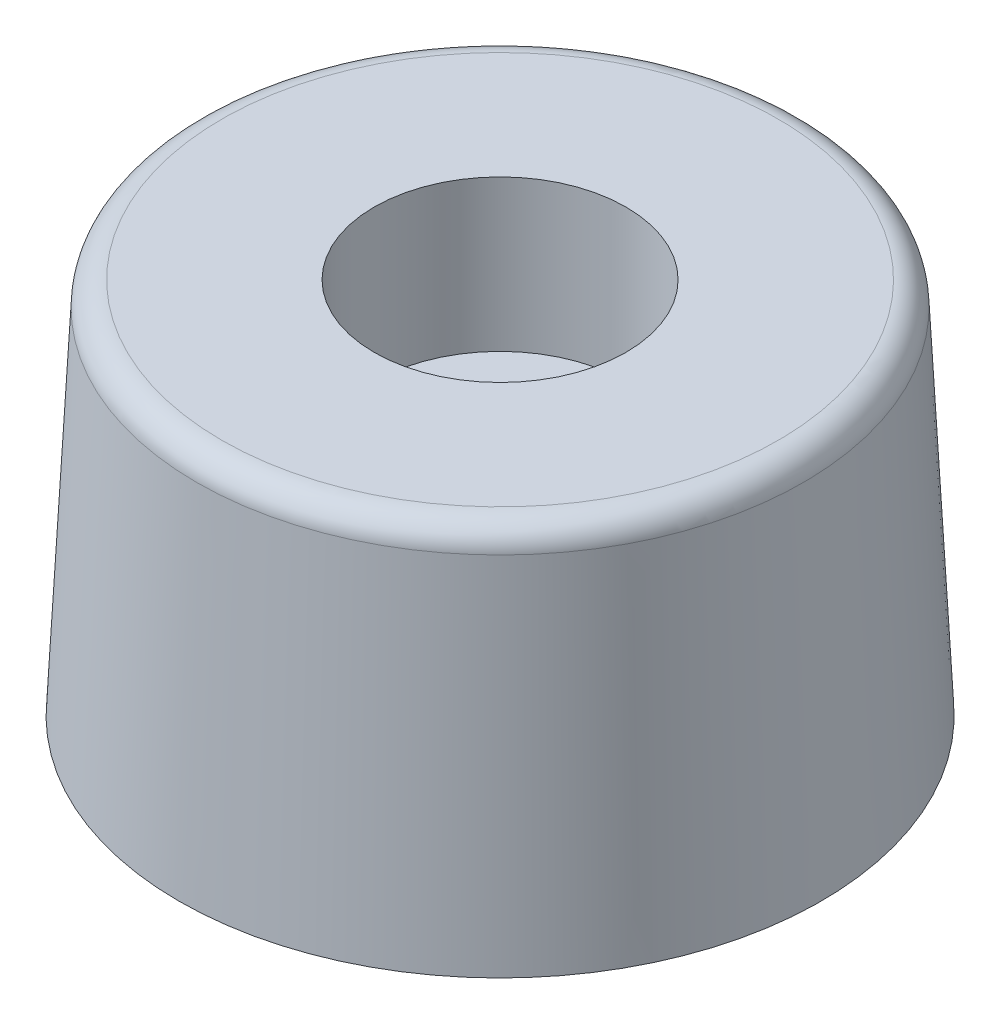
ISO-10303-21;
HEADER;
FILE_DESCRIPTION(('STEP AP214'),'2;1');
FILE_NAME('part.step','',(''),(''),'','','');
FILE_SCHEMA(('AUTOMOTIVE_DESIGN { 1 0 10303 214 1 1 1 1 }'));
ENDSEC;
DATA;
#1=APPLICATION_CONTEXT('core data for automotive mechanical design processes');
#2=APPLICATION_PROTOCOL_DEFINITION('international standard','automotive_design',2000,#1);
#3=PRODUCT_CONTEXT('',#1,'mechanical');
#4=PRODUCT('Part','Part','',(#3));
#5=PRODUCT_RELATED_PRODUCT_CATEGORY('part','',(#4));
#6=PRODUCT_DEFINITION_FORMATION('','',#4);
#7=PRODUCT_DEFINITION_CONTEXT('part definition',#1,'design');
#8=PRODUCT_DEFINITION('design','',#6,#7);
#9=PRODUCT_DEFINITION_SHAPE('','',#8);
#10=(LENGTH_UNIT() NAMED_UNIT(*) SI_UNIT(.MILLI.,.METRE.));
#11=(NAMED_UNIT(*) PLANE_ANGLE_UNIT() SI_UNIT($,.RADIAN.));
#12=(NAMED_UNIT(*) SI_UNIT($,.STERADIAN.) SOLID_ANGLE_UNIT());
#13=UNCERTAINTY_MEASURE_WITH_UNIT(LENGTH_MEASURE(1.E-05),#10,'distance_accuracy_value','');
#14=(GEOMETRIC_REPRESENTATION_CONTEXT(3) GLOBAL_UNCERTAINTY_ASSIGNED_CONTEXT((#13)) GLOBAL_UNIT_ASSIGNED_CONTEXT((#10,
#11,#12)) REPRESENTATION_CONTEXT('',''));
#15=CARTESIAN_POINT('',(0.,0.,0.));
#16=DIRECTION('',(0.,0.,1.));
#17=DIRECTION('',(1.,0.,0.));
#18=AXIS2_PLACEMENT_3D('',#15,#16,#17);
#19=CARTESIAN_POINT('',(0.,0.,0.));
#20=DIRECTION('',(0.,1.,0.));
#21=DIRECTION('',(0.,0.,1.));
#22=AXIS2_PLACEMENT_3D('',#19,#20,#21);
#23=PLANE('',#22);
#24=CARTESIAN_POINT('',(0.,0.,0.));
#25=DIRECTION('',(0.,1.,0.));
#26=DIRECTION('',(0.,0.,1.));
#27=AXIS2_PLACEMENT_3D('',#24,#25,#26);
#28=CIRCLE('',#27,2.5);
#29=CARTESIAN_POINT('',(0.,0.,2.5));
#30=VERTEX_POINT('',#29);
#31=EDGE_CURVE('E65',#30,#30,#28,.T.);
#32=ORIENTED_EDGE('',*,*,#31,.T.);
#33=EDGE_LOOP('',(#32));
#34=FACE_BOUND('',#33,.T.);
#35=CARTESIAN_POINT('',(0.,0.,0.));
#36=DIRECTION('',(0.,1.,0.));
#37=DIRECTION('',(0.,0.,1.));
#38=AXIS2_PLACEMENT_3D('',#35,#36,#37);
#39=CIRCLE('',#38,12.75);
#40=CARTESIAN_POINT('',(0.,0.,12.75));
#41=VERTEX_POINT('',#40);
#42=EDGE_CURVE('E26',#41,#41,#39,.T.);
#43=ORIENTED_EDGE('',*,*,#42,.F.);
#44=EDGE_LOOP('',(#43));
#45=FACE_BOUND('',#44,.T.);
#46=ADVANCED_FACE('F15',(#34,#45),#23,.F.);
#47=CARTESIAN_POINT('',(0.,15.,0.));
#48=DIRECTION('',(0.,1.,0.));
#49=DIRECTION('',(0.,0.,1.));
#50=AXIS2_PLACEMENT_3D('',#47,#48,#49);
#51=PLANE('',#50);
#52=CARTESIAN_POINT('',(0.,15.,0.));
#53=DIRECTION('',(0.,1.,0.));
#54=DIRECTION('',(0.,0.,1.));
#55=AXIS2_PLACEMENT_3D('',#52,#53,#54);
#56=CIRCLE('',#55,5.);
#57=CARTESIAN_POINT('',(0.,15.,5.));
#58=VERTEX_POINT('',#57);
#59=EDGE_CURVE('E62',#58,#58,#56,.T.);
#60=ORIENTED_EDGE('',*,*,#59,.F.);
#61=EDGE_LOOP('',(#60));
#62=FACE_BOUND('',#61,.T.);
#63=CARTESIAN_POINT('',(0.,15.,0.));
#64=DIRECTION('',(0.,1.,0.));
#65=DIRECTION('',(0.,0.,1.));
#66=AXIS2_PLACEMENT_3D('',#63,#64,#65);
#67=CIRCLE('',#66,11.048750780275);
#68=CARTESIAN_POINT('',(0.,15.,11.048750780275));
#69=VERTEX_POINT('',#68);
#70=EDGE_CURVE('E22',#69,#69,#67,.T.);
#71=ORIENTED_EDGE('',*,*,#70,.T.);
#72=EDGE_LOOP('',(#71));
#73=FACE_BOUND('',#72,.T.);
#74=ADVANCED_FACE('F45',(#62,#73),#51,.T.);
#75=CARTESIAN_POINT('',(0.,15.,0.));
#76=DIRECTION('',(0.,-1.,0.));
#77=DIRECTION('',(0.,0.,-1.));
#78=AXIS2_PLACEMENT_3D('',#75,#76,#77);
#79=CONICAL_SURFACE('',#78,12.,0.0499583957219426);
#80=CARTESIAN_POINT('',(0.,14.0499376169439,0.));
#81=DIRECTION('',(0.,1.,0.));
#82=DIRECTION('',(0.,0.,1.));
#83=AXIS2_PLACEMENT_3D('',#80,#81,#82);
#84=CIRCLE('',#83,12.0475031191528);
#85=CARTESIAN_POINT('',(0.,14.0499376169439,12.0475031191528));
#86=VERTEX_POINT('',#85);
#87=EDGE_CURVE('E10',#86,#86,#84,.F.);
#88=ORIENTED_EDGE('',*,*,#87,.T.);
#89=EDGE_LOOP('',(#88));
#90=FACE_BOUND('',#89,.T.);
#91=ORIENTED_EDGE('',*,*,#42,.T.);
#92=EDGE_LOOP('',(#91));
#93=FACE_BOUND('',#92,.T.);
#94=ADVANCED_FACE('F47',(#90,#93),#79,.T.);
#95=CARTESIAN_POINT('',(0.,14.,0.));
#96=DIRECTION('',(0.,1.,0.));
#97=DIRECTION('',(0.,0.,1.));
#98=AXIS2_PLACEMENT_3D('',#95,#96,#97);
#99=TOROIDAL_SURFACE('',#98,11.048750780275,1.);
#100=ORIENTED_EDGE('',*,*,#87,.F.);
#101=EDGE_LOOP('',(#100));
#102=FACE_BOUND('',#101,.T.);
#103=ORIENTED_EDGE('',*,*,#70,.F.);
#104=EDGE_LOOP('',(#103));
#105=FACE_BOUND('',#104,.T.);
#106=ADVANCED_FACE('F17',(#102,#105),#99,.T.);
#107=CARTESIAN_POINT('',(0.,9.,0.));
#108=DIRECTION('',(0.,1.,0.));
#109=DIRECTION('',(0.,0.,1.));
#110=AXIS2_PLACEMENT_3D('',#107,#108,#109);
#111=CYLINDRICAL_SURFACE('',#110,5.);
#112=CARTESIAN_POINT('',(0.,9.,0.));
#113=DIRECTION('',(0.,1.,0.));
#114=DIRECTION('',(0.,0.,1.));
#115=AXIS2_PLACEMENT_3D('',#112,#113,#114);
#116=CIRCLE('',#115,5.);
#117=CARTESIAN_POINT('',(0.,9.,5.));
#118=VERTEX_POINT('',#117);
#119=EDGE_CURVE('E30',#118,#118,#116,.T.);
#120=ORIENTED_EDGE('',*,*,#119,.F.);
#121=EDGE_LOOP('',(#120));
#122=FACE_BOUND('',#121,.T.);
#123=ORIENTED_EDGE('',*,*,#59,.T.);
#124=EDGE_LOOP('',(#123));
#125=FACE_BOUND('',#124,.T.);
#126=ADVANCED_FACE('F80',(#122,#125),#111,.F.);
#127=CARTESIAN_POINT('',(0.,9.,0.));
#128=DIRECTION('',(0.,1.,0.));
#129=DIRECTION('',(0.,0.,1.));
#130=AXIS2_PLACEMENT_3D('',#127,#128,#129);
#131=PLANE('',#130);
#132=CARTESIAN_POINT('',(0.,9.,0.));
#133=DIRECTION('',(0.,1.,0.));
#134=DIRECTION('',(0.,0.,1.));
#135=AXIS2_PLACEMENT_3D('',#132,#133,#134);
#136=CIRCLE('',#135,2.5);
#137=CARTESIAN_POINT('',(0.,9.,2.5));
#138=VERTEX_POINT('',#137);
#139=EDGE_CURVE('E70',#138,#138,#136,.T.);
#140=ORIENTED_EDGE('',*,*,#139,.F.);
#141=EDGE_LOOP('',(#140));
#142=FACE_BOUND('',#141,.T.);
#143=ORIENTED_EDGE('',*,*,#119,.T.);
#144=EDGE_LOOP('',(#143));
#145=FACE_BOUND('',#144,.T.);
#146=ADVANCED_FACE('F77',(#142,#145),#131,.T.);
#147=CARTESIAN_POINT('',(0.,-31.,0.));
#148=DIRECTION('',(0.,1.,0.));
#149=DIRECTION('',(0.,0.,1.));
#150=AXIS2_PLACEMENT_3D('',#147,#148,#149);
#151=CYLINDRICAL_SURFACE('',#150,2.5);
#152=ORIENTED_EDGE('',*,*,#139,.T.);
#153=EDGE_LOOP('',(#152));
#154=FACE_BOUND('',#153,.T.);
#155=ORIENTED_EDGE('',*,*,#31,.F.);
#156=EDGE_LOOP('',(#155));
#157=FACE_BOUND('',#156,.T.);
#158=ADVANCED_FACE('F74',(#154,#157),#151,.F.);
#159=CLOSED_SHELL('',(#46,#74,#94,#106,#126,#146,#158));
#160=MANIFOLD_SOLID_BREP('B1',#159);
#161=ADVANCED_BREP_SHAPE_REPRESENTATION('',(#18,#160),#14);
#162=SHAPE_DEFINITION_REPRESENTATION(#9,#161);
ENDSEC;
END-ISO-10303-21;
